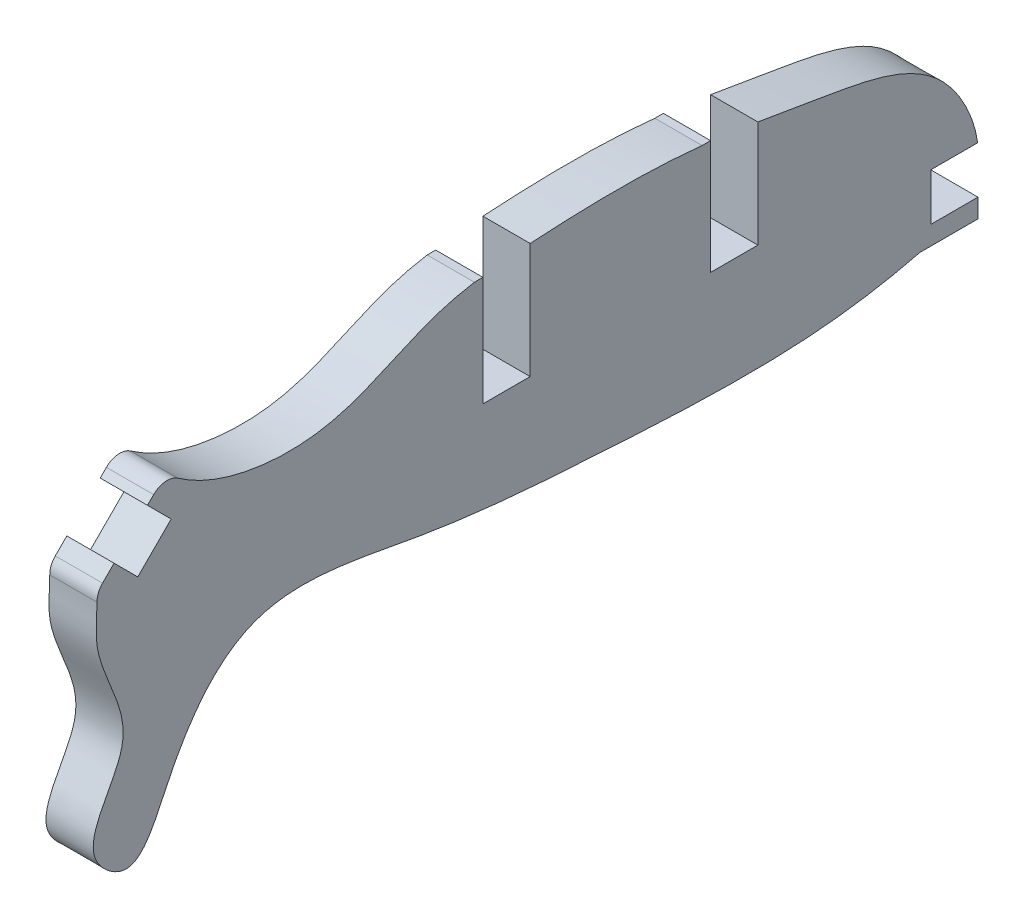
ISO-10303-21;
HEADER;
FILE_DESCRIPTION(('STEP AP214'),'2;1');
FILE_NAME('part.step','',(''),(''),'','','');
FILE_SCHEMA(('AUTOMOTIVE_DESIGN { 1 0 10303 214 1 1 1 1 }'));
ENDSEC;
DATA;
#1=APPLICATION_CONTEXT('core data for automotive mechanical design processes');
#2=APPLICATION_PROTOCOL_DEFINITION('international standard','automotive_design',2000,#1);
#3=PRODUCT_CONTEXT('',#1,'mechanical');
#4=PRODUCT('Part','Part','',(#3));
#5=PRODUCT_RELATED_PRODUCT_CATEGORY('part','',(#4));
#6=PRODUCT_DEFINITION_FORMATION('','',#4);
#7=PRODUCT_DEFINITION_CONTEXT('part definition',#1,'design');
#8=PRODUCT_DEFINITION('design','',#6,#7);
#9=PRODUCT_DEFINITION_SHAPE('','',#8);
#10=(LENGTH_UNIT() NAMED_UNIT(*) SI_UNIT(.MILLI.,.METRE.));
#11=(NAMED_UNIT(*) PLANE_ANGLE_UNIT() SI_UNIT($,.RADIAN.));
#12=(NAMED_UNIT(*) SI_UNIT($,.STERADIAN.) SOLID_ANGLE_UNIT());
#13=UNCERTAINTY_MEASURE_WITH_UNIT(LENGTH_MEASURE(1.E-05),#10,'distance_accuracy_value','');
#14=(GEOMETRIC_REPRESENTATION_CONTEXT(3) GLOBAL_UNCERTAINTY_ASSIGNED_CONTEXT((#13)) GLOBAL_UNIT_ASSIGNED_CONTEXT((#10,
#11,#12)) REPRESENTATION_CONTEXT('',''));
#15=CARTESIAN_POINT('',(0.,0.,0.));
#16=DIRECTION('',(0.,0.,1.));
#17=DIRECTION('',(1.,0.,0.));
#18=AXIS2_PLACEMENT_3D('',#15,#16,#17);
#19=CARTESIAN_POINT('',(2.5,0.,0.));
#20=CARTESIAN_POINT('',(2.5,-0.541084528293463,-0.272473622424354));
#21=CARTESIAN_POINT('',(2.5,-2.10406584461799,-2.1778954166779));
#22=CARTESIAN_POINT('',(2.5,3.36117006970857,-4.25993897825765));
#23=CARTESIAN_POINT('',(2.5,8.30902129392191,-8.27303154593728));
#24=CARTESIAN_POINT('',(2.5,5.98429483389327,-17.5880406060923));
#25=CARTESIAN_POINT('',(2.5,5.37939179539656,-26.3059395788136));
#26=CARTESIAN_POINT('',(2.5,4.87928385677255,-35.2834623387502));
#27=CARTESIAN_POINT('',(2.5,5.48110894278195,-41.5391302106125));
#28=CARTESIAN_POINT('',(2.5,7.22840901590548,-47.7254062217009));
#29=CARTESIAN_POINT('',(2.5,14.6410347918461,-45.3927229469363));
#30=CARTESIAN_POINT('',(2.5,15.770669640676,-38.4007919561818));
#31=CARTESIAN_POINT('',(2.5,17.1217746718688,-31.0703671268736));
#32=CARTESIAN_POINT('',(2.5,16.9701055404972,-24.2198236812376));
#33=CARTESIAN_POINT('',(2.5,16.4230201003298,-17.6842465114785));
#34=CARTESIAN_POINT('',(2.5,13.0552754329594,-12.4328992588877));
#35=CARTESIAN_POINT('',(2.5,14.0463219172787,-5.3266395441336));
#36=CARTESIAN_POINT('',(2.5,17.0233611147964,-2.43679313670869));
#37=CARTESIAN_POINT('',(2.5,18.9835071570872,0.735781673182484));
#38=CARTESIAN_POINT('',(2.5,18.3609569736637,1.5863093965143));
#39=CARTESIAN_POINT('',(2.5,15.5581520784163,2.14979371394474));
#40=CARTESIAN_POINT('',(2.5,13.3832377511273,-0.435409892481267));
#41=CARTESIAN_POINT('',(2.5,8.86671384343193,0.440571098837827));
#42=CARTESIAN_POINT('',(2.5,4.95139910077309,-3.07383649344975));
#43=CARTESIAN_POINT('',(2.5,1.42417024966847,0.717168587503393));
#44=CARTESIAN_POINT('',(2.5,0.,0.));
#45=B_SPLINE_CURVE_WITH_KNOTS('',3,(#19,#20,#21,#22,#23,#24,#25,#26,#27,#28,#29,#30,#31,#32,#33,
#34,#35,#36,#37,#38,#39,#40,#41,#42,#43,#44),.UNSPECIFIED.,.T.,.F.,(4,1,1,1,1,1,1,1,1,1,1,1,1,1,
1,1,1,1,1,1,1,1,1,4),(0.,0.0146402414672483,0.0445395881156549,0.100042075294855,
0.16816746605923,0.246997948314105,0.320837358889482,0.378909911688516,0.408310293551712,
0.453091621050885,0.510176836741603,0.569621449295567,0.635352586889172,0.674982328591815,
0.725528496203896,0.782456251225519,0.824214189069101,0.842758224795276,0.845967518506037,
0.856307126176709,0.898464266637791,0.915761934425582,0.961465916589082,1.),.UNSPECIFIED.);
#46=DIRECTION('',(-1.,0.,0.));
#47=VECTOR('',#46,1.);
#48=SURFACE_OF_LINEAR_EXTRUSION('',#45,#47);
#49=CARTESIAN_POINT('',(0.,0.,0.));
#50=CARTESIAN_POINT('',(0.,-0.541084528293463,-0.272473622424354));
#51=CARTESIAN_POINT('',(0.,-2.10406584461799,-2.1778954166779));
#52=CARTESIAN_POINT('',(0.,3.36117006970857,-4.25993897825765));
#53=CARTESIAN_POINT('',(0.,8.30902129392191,-8.27303154593728));
#54=CARTESIAN_POINT('',(0.,5.98429483389327,-17.5880406060923));
#55=CARTESIAN_POINT('',(0.,5.37939179539656,-26.3059395788136));
#56=CARTESIAN_POINT('',(0.,4.87928385677255,-35.2834623387502));
#57=CARTESIAN_POINT('',(0.,5.48110894278195,-41.5391302106125));
#58=CARTESIAN_POINT('',(0.,7.22840901590548,-47.7254062217009));
#59=CARTESIAN_POINT('',(0.,14.6410347918461,-45.3927229469363));
#60=CARTESIAN_POINT('',(0.,15.770669640676,-38.4007919561818));
#61=CARTESIAN_POINT('',(0.,17.1217746718688,-31.0703671268736));
#62=CARTESIAN_POINT('',(0.,16.9701055404972,-24.2198236812376));
#63=CARTESIAN_POINT('',(0.,16.4230201003298,-17.6842465114785));
#64=CARTESIAN_POINT('',(0.,13.0552754329594,-12.4328992588877));
#65=CARTESIAN_POINT('',(0.,14.0463219172787,-5.3266395441336));
#66=CARTESIAN_POINT('',(0.,17.0233611147964,-2.43679313670869));
#67=CARTESIAN_POINT('',(0.,18.9835071570872,0.735781673182484));
#68=CARTESIAN_POINT('',(0.,18.3609569736637,1.5863093965143));
#69=CARTESIAN_POINT('',(0.,15.5581520784163,2.14979371394474));
#70=CARTESIAN_POINT('',(0.,13.3832377511273,-0.435409892481267));
#71=CARTESIAN_POINT('',(0.,8.86671384343193,0.440571098837827));
#72=CARTESIAN_POINT('',(0.,4.95139910077309,-3.07383649344975));
#73=CARTESIAN_POINT('',(0.,1.42417024966847,0.717168587503393));
#74=CARTESIAN_POINT('',(0.,0.,0.));
#75=B_SPLINE_CURVE_WITH_KNOTS('',3,(#49,#50,#51,#52,#53,#54,#55,#56,#57,#58,#59,#60,#61,#62,#63,
#64,#65,#66,#67,#68,#69,#70,#71,#72,#73,#74),.UNSPECIFIED.,.T.,.F.,(4,1,1,1,1,1,1,1,1,1,1,1,1,1,
1,1,1,1,1,1,1,1,1,4),(0.,0.0146402414672483,0.0445395881156549,0.100042075294855,
0.16816746605923,0.246997948314105,0.320837358889482,0.378909911688516,0.408310293551712,
0.453091621050885,0.510176836741603,0.569621449295567,0.635352586889172,0.674982328591815,
0.725528496203896,0.782456251225519,0.824214189069101,0.842758224795276,0.845967518506037,
0.856307126176709,0.898464266637791,0.915761934425582,0.961465916589082,1.),.UNSPECIFIED.);
#76=CARTESIAN_POINT('',(0.,11.8514874548388,-0.0264150590870313));
#77=VERTEX_POINT('',#76);
#78=CARTESIAN_POINT('',(0.,6.10502250331146,-43.5882828738837));
#79=VERTEX_POINT('',#78);
#80=EDGE_CURVE('E276',#77,#79,#75,.T.);
#81=ORIENTED_EDGE('',*,*,#80,.T.);
#82=DIRECTION('',(-1.,0.,0.));
#83=VECTOR('',#82,1.);
#84=CARTESIAN_POINT('',(2.5,6.10502250331141,-43.5882825718638));
#85=LINE('',#84,#83);
#86=CARTESIAN_POINT('',(2.5,6.10502250331146,-43.5882825249099));
#87=VERTEX_POINT('',#86);
#88=EDGE_CURVE('E233',#87,#79,#85,.T.);
#89=ORIENTED_EDGE('',*,*,#88,.F.);
#90=CARTESIAN_POINT('',(2.5,11.8514874548388,-0.0264150590870313));
#91=VERTEX_POINT('',#90);
#92=EDGE_CURVE('E291',#91,#87,#45,.T.);
#93=ORIENTED_EDGE('',*,*,#92,.F.);
#94=DIRECTION('',(-1.,0.,0.));
#95=VECTOR('',#94,1.);
#96=CARTESIAN_POINT('',(2.5,11.8514874548388,-0.0264150590870314));
#97=LINE('',#96,#95);
#98=EDGE_CURVE('E281',#91,#77,#97,.T.);
#99=ORIENTED_EDGE('',*,*,#98,.T.);
#100=EDGE_LOOP('',(#81,#89,#93,#99));
#101=FACE_BOUND('',#100,.T.);
#102=ADVANCED_FACE('F37',(#101),#48,.F.);
#103=CARTESIAN_POINT('',(2.5,15.5377458684864,-39.8702375089103));
#104=DIRECTION('',(1.,0.,0.));
#105=DIRECTION('',(0.,0.,-1.));
#106=AXIS2_PLACEMENT_3D('',#103,#104,#105);
#107=PLANE('',#106);
#108=DIRECTION('',(0.,0.,1.));
#109=VECTOR('',#108,1.);
#110=CARTESIAN_POINT('',(2.5,7.10268511937784,-39.8702375089103));
#111=LINE('',#110,#109);
#112=CARTESIAN_POINT('',(2.5,7.10268511937784,-46.65));
#113=VERTEX_POINT('',#112);
#114=CARTESIAN_POINT('',(2.5,7.10268511937784,-44.15));
#115=VERTEX_POINT('',#114);
#116=EDGE_CURVE('E227',#113,#115,#111,.T.);
#117=ORIENTED_EDGE('',*,*,#116,.T.);
#118=DIRECTION('',(0.,-1.,0.));
#119=VECTOR('',#118,1.);
#120=CARTESIAN_POINT('',(2.5,15.5377458684864,-44.15));
#121=LINE('',#120,#119);
#122=CARTESIAN_POINT('',(2.5,9.60268511937784,-44.15));
#123=VERTEX_POINT('',#122);
#124=EDGE_CURVE('E363',#123,#115,#121,.T.);
#125=ORIENTED_EDGE('',*,*,#124,.F.);
#126=DIRECTION('',(0.,0.,-1.));
#127=VECTOR('',#126,1.);
#128=CARTESIAN_POINT('',(2.5,9.60268511937784,-39.8702375089103));
#129=LINE('',#128,#127);
#130=CARTESIAN_POINT('',(2.5,9.60268511937785,-46.6323468524195));
#131=VERTEX_POINT('',#130);
#132=EDGE_CURVE('E64',#123,#131,#129,.T.);
#133=ORIENTED_EDGE('',*,*,#132,.T.);
#134=CARTESIAN_POINT('',(2.5,16.373242104138,-35.));
#135=VERTEX_POINT('',#134);
#136=EDGE_CURVE('E372',#131,#135,#45,.T.);
#137=ORIENTED_EDGE('',*,*,#136,.T.);
#138=DIRECTION('',(0.,1.,0.));
#139=VECTOR('',#138,1.);
#140=CARTESIAN_POINT('',(2.5,10.7286242334819,-35.));
#141=LINE('',#140,#139);
#142=CARTESIAN_POINT('',(2.5,10.7286242334819,-35.));
#143=VERTEX_POINT('',#142);
#144=EDGE_CURVE('E335',#143,#135,#141,.T.);
#145=ORIENTED_EDGE('',*,*,#144,.F.);
#146=DIRECTION('',(0.,0.,-1.));
#147=VECTOR('',#146,1.);
#148=CARTESIAN_POINT('',(2.5,10.7286242334819,-32.05));
#149=LINE('',#148,#147);
#150=CARTESIAN_POINT('',(2.5,10.7286242334819,-32.5));
#151=VERTEX_POINT('',#150);
#152=EDGE_CURVE('E280',#151,#143,#149,.T.);
#153=ORIENTED_EDGE('',*,*,#152,.F.);
#154=DIRECTION('',(0.,1.,0.));
#155=VECTOR('',#154,1.);
#156=CARTESIAN_POINT('',(2.5,16.7676365159543,-32.5));
#157=LINE('',#156,#155);
#158=CARTESIAN_POINT('',(2.5,16.7676365159543,-32.5));
#159=VERTEX_POINT('',#158);
#160=EDGE_CURVE('E238',#151,#159,#157,.T.);
#161=ORIENTED_EDGE('',*,*,#160,.T.);
#162=DIRECTION('',(0.,0.,1.));
#163=VECTOR('',#162,1.);
#164=CARTESIAN_POINT('',(2.5,16.7676365159543,-32.05));
#165=LINE('',#164,#163);
#166=CARTESIAN_POINT('',(2.5,16.7676365159543,-32.05));
#167=VERTEX_POINT('',#166);
#168=EDGE_CURVE('E244',#159,#167,#165,.T.);
#169=ORIENTED_EDGE('',*,*,#168,.T.);
#170=CARTESIAN_POINT('',(2.5,16.8294396817294,-22.95));
#171=VERTEX_POINT('',#170);
#172=EDGE_CURVE('E324',#167,#171,#45,.T.);
#173=ORIENTED_EDGE('',*,*,#172,.T.);
#174=DIRECTION('',(0.,1.,0.));
#175=VECTOR('',#174,1.);
#176=CARTESIAN_POINT('',(2.5,10.7286242334819,-22.95));
#177=LINE('',#176,#175);
#178=CARTESIAN_POINT('',(2.5,10.7286242334819,-22.95));
#179=VERTEX_POINT('',#178);
#180=EDGE_CURVE('E320',#179,#171,#177,.T.);
#181=ORIENTED_EDGE('',*,*,#180,.F.);
#182=DIRECTION('',(0.,0.,1.));
#183=VECTOR('',#182,1.);
#184=CARTESIAN_POINT('',(2.5,10.7286242334819,-22.95));
#185=LINE('',#184,#183);
#186=CARTESIAN_POINT('',(2.5,10.7286242334819,-20.45));
#187=VERTEX_POINT('',#186);
#188=EDGE_CURVE('E321',#179,#187,#185,.T.);
#189=ORIENTED_EDGE('',*,*,#188,.T.);
#190=DIRECTION('',(0.,1.,0.));
#191=VECTOR('',#190,1.);
#192=CARTESIAN_POINT('',(2.5,10.7286242334819,-20.45));
#193=LINE('',#192,#191);
#194=CARTESIAN_POINT('',(2.5,16.5272078463722,-20.45));
#195=VERTEX_POINT('',#194);
#196=EDGE_CURVE('E254',#187,#195,#193,.T.);
#197=ORIENTED_EDGE('',*,*,#196,.T.);
#198=DIRECTION('',(0.,0.,1.));
#199=VECTOR('',#198,1.);
#200=CARTESIAN_POINT('',(2.5,16.5272078463722,-20.45));
#201=LINE('',#200,#199);
#202=CARTESIAN_POINT('',(2.5,16.5272078463722,-20.));
#203=VERTEX_POINT('',#202);
#204=EDGE_CURVE('E260',#195,#203,#201,.T.);
#205=ORIENTED_EDGE('',*,*,#204,.T.);
#206=CARTESIAN_POINT('',(2.5,15.3990003489705,-4.29662501733366));
#207=VERTEX_POINT('',#206);
#208=EDGE_CURVE('E288',#203,#207,#45,.T.);
#209=ORIENTED_EDGE('',*,*,#208,.T.);
#210=CARTESIAN_POINT('',(2.5,14.5737930702256,-3.73179500121685));
#211=DIRECTION('',(1.,0.,0.));
#212=DIRECTION('',(0.,0.,-1.));
#213=AXIS2_PLACEMENT_3D('',#210,#211,#212);
#214=CIRCLE('',#213,1.);
#215=CARTESIAN_POINT('',(2.5,15.280899853524,-3.02468822214213));
#216=VERTEX_POINT('',#215);
#217=EDGE_CURVE('E285',#207,#216,#214,.T.);
#218=ORIENTED_EDGE('',*,*,#217,.T.);
#219=DIRECTION('',(0.,0.707106779074716,-0.707106783298379));
#220=VECTOR('',#219,1.);
#221=CARTESIAN_POINT('',(2.5,12.2562116247336,2.4715227884024E-08));
#222=LINE('',#221,#220);
#223=CARTESIAN_POINT('',(2.5,14.9540070717488,-2.69779543841433));
#224=VERTEX_POINT('',#223);
#225=EDGE_CURVE('E303',#224,#216,#222,.T.);
#226=ORIENTED_EDGE('',*,*,#225,.F.);
#227=DIRECTION('',(0.,0.707106783298379,0.707106779074716));
#228=VECTOR('',#227,1.);
#229=CARTESIAN_POINT('',(2.5,13.6988925313942,-3.95290997127195));
#230=LINE('',#229,#228);
#231=CARTESIAN_POINT('',(2.5,13.6988925313942,-3.95290997127195));
#232=VERTEX_POINT('',#231);
#233=EDGE_CURVE('E353',#232,#224,#230,.T.);
#234=ORIENTED_EDGE('',*,*,#233,.F.);
#235=DIRECTION('',(0.,0.707106779074717,-0.707106783298378));
#236=VECTOR('',#235,1.);
#237=CARTESIAN_POINT('',(2.5,11.9311255837074,-2.185143013026));
#238=LINE('',#237,#236);
#239=CARTESIAN_POINT('',(2.5,11.9311255837074,-2.185143013026));
#240=VERTEX_POINT('',#239);
#241=EDGE_CURVE('E364',#240,#232,#238,.T.);
#242=ORIENTED_EDGE('',*,*,#241,.F.);
#243=DIRECTION('',(0.,0.707106783298379,0.707106779074716));
#244=VECTOR('',#243,1.);
#245=CARTESIAN_POINT('',(2.5,11.9311255837074,-2.185143013026));
#246=LINE('',#245,#244);
#247=CARTESIAN_POINT('',(2.5,13.186240124062,-0.93002848016838));
#248=VERTEX_POINT('',#247);
#249=EDGE_CURVE('E287',#240,#248,#246,.T.);
#250=ORIENTED_EDGE('',*,*,#249,.T.);
#251=CARTESIAN_POINT('',(2.5,12.5753790526333,-0.319167405090885));
#252=VERTEX_POINT('',#251);
#253=EDGE_CURVE('E279',#252,#248,#222,.T.);
#254=ORIENTED_EDGE('',*,*,#253,.F.);
#255=CARTESIAN_POINT('',(2.5,11.8682722693352,-1.02627418416532));
#256=DIRECTION('',(1.,0.,0.));
#257=DIRECTION('',(0.,0.,-1.));
#258=AXIS2_PLACEMENT_3D('',#255,#256,#257);
#259=CIRCLE('',#258,1.);
#260=EDGE_CURVE('E289',#252,#91,#259,.T.);
#261=ORIENTED_EDGE('',*,*,#260,.T.);
#262=ORIENTED_EDGE('',*,*,#92,.T.);
#263=DIRECTION('',(0.,0.,-1.));
#264=VECTOR('',#263,1.);
#265=CARTESIAN_POINT('',(2.5,6.10502250331146,0.174173426554514));
#266=LINE('',#265,#264);
#267=CARTESIAN_POINT('',(2.5,6.10502250331146,-46.65));
#268=VERTEX_POINT('',#267);
#269=EDGE_CURVE('E235',#87,#268,#266,.T.);
#270=ORIENTED_EDGE('',*,*,#269,.T.);
#271=DIRECTION('',(0.,1.,0.));
#272=VECTOR('',#271,1.);
#273=CARTESIAN_POINT('',(2.5,7.10268511937784,-46.65));
#274=LINE('',#273,#272);
#275=EDGE_CURVE('E231',#268,#113,#274,.T.);
#276=ORIENTED_EDGE('',*,*,#275,.T.);
#277=EDGE_LOOP('',(#117,#125,#133,#137,#145,#153,#161,#169,#173,#181,#189,#197,#205,#209,#218,
#226,#234,#242,#250,#254,#261,#262,#270,#276));
#278=FACE_BOUND('',#277,.T.);
#279=ADVANCED_FACE('F39',(#278),#107,.T.);
#280=DIRECTION('',(-1.,0.,0.));
#281=VECTOR('',#280,1.);
#282=CARTESIAN_POINT('',(2.5,9.60268511937785,-46.6323468524195));
#283=LINE('',#282,#281);
#284=CARTESIAN_POINT('',(0.,9.60268511937784,-46.6323468498637));
#285=VERTEX_POINT('',#284);
#286=EDGE_CURVE('E213',#285,#131,#283,.F.);
#287=ORIENTED_EDGE('',*,*,#286,.F.);
#288=CARTESIAN_POINT('',(0.,16.373242104138,-35.));
#289=VERTEX_POINT('',#288);
#290=EDGE_CURVE('E334',#285,#289,#75,.T.);
#291=ORIENTED_EDGE('',*,*,#290,.T.);
#292=DIRECTION('',(-1.,0.,0.));
#293=VECTOR('',#292,1.);
#294=CARTESIAN_POINT('',(2.5,16.3732421067557,-35.));
#295=LINE('',#294,#293);
#296=EDGE_CURVE('E284',#289,#135,#295,.F.);
#297=ORIENTED_EDGE('',*,*,#296,.T.);
#298=ORIENTED_EDGE('',*,*,#136,.F.);
#299=EDGE_LOOP('',(#287,#291,#297,#298));
#300=FACE_BOUND('',#299,.T.);
#301=ADVANCED_FACE('F389',(#300),#48,.F.);
#302=CARTESIAN_POINT('',(0.,15.5377458684864,-39.8702375089103));
#303=DIRECTION('',(1.,0.,0.));
#304=DIRECTION('',(0.,0.,-1.));
#305=AXIS2_PLACEMENT_3D('',#302,#303,#304);
#306=PLANE('',#305);
#307=DIRECTION('',(0.,0.,1.));
#308=VECTOR('',#307,1.);
#309=CARTESIAN_POINT('',(0.,7.10268511937784,-39.8702375089103));
#310=LINE('',#309,#308);
#311=CARTESIAN_POINT('',(0.,7.10268511937784,-46.65));
#312=VERTEX_POINT('',#311);
#313=CARTESIAN_POINT('',(0.,7.10268511937784,-44.15));
#314=VERTEX_POINT('',#313);
#315=EDGE_CURVE('E48',#312,#314,#310,.T.);
#316=ORIENTED_EDGE('',*,*,#315,.F.);
#317=DIRECTION('',(0.,-1.,0.));
#318=VECTOR('',#317,1.);
#319=CARTESIAN_POINT('',(0.,7.10268511937784,-46.65));
#320=LINE('',#319,#318);
#321=CARTESIAN_POINT('',(0.,6.10502250331146,-46.65));
#322=VERTEX_POINT('',#321);
#323=EDGE_CURVE('E208',#312,#322,#320,.T.);
#324=ORIENTED_EDGE('',*,*,#323,.T.);
#325=DIRECTION('',(0.,0.,-1.));
#326=VECTOR('',#325,1.);
#327=CARTESIAN_POINT('',(0.,6.10502250331146,0.174173426554514));
#328=LINE('',#327,#326);
#329=EDGE_CURVE('E236',#79,#322,#328,.T.);
#330=ORIENTED_EDGE('',*,*,#329,.F.);
#331=ORIENTED_EDGE('',*,*,#80,.F.);
#332=CARTESIAN_POINT('',(0.,11.8682722693352,-1.02627418416532));
#333=DIRECTION('',(1.,0.,0.));
#334=DIRECTION('',(0.,0.,-1.));
#335=AXIS2_PLACEMENT_3D('',#332,#333,#334);
#336=CIRCLE('',#335,1.);
#337=CARTESIAN_POINT('',(0.,12.5753790526333,-0.319167405090885));
#338=VERTEX_POINT('',#337);
#339=EDGE_CURVE('E275',#77,#338,#336,.F.);
#340=ORIENTED_EDGE('',*,*,#339,.T.);
#341=DIRECTION('',(0.,0.707106779074716,-0.707106783298379));
#342=VECTOR('',#341,1.);
#343=CARTESIAN_POINT('',(0.,12.2562116247336,2.4715227884024E-08));
#344=LINE('',#343,#342);
#345=CARTESIAN_POINT('',(0.,13.186240124062,-0.930028480168383));
#346=VERTEX_POINT('',#345);
#347=EDGE_CURVE('E299',#338,#346,#344,.T.);
#348=ORIENTED_EDGE('',*,*,#347,.T.);
#349=DIRECTION('',(0.,0.707106783298379,0.707106779074716));
#350=VECTOR('',#349,1.);
#351=CARTESIAN_POINT('',(0.,11.9311255837074,-2.185143013026));
#352=LINE('',#351,#350);
#353=CARTESIAN_POINT('',(0.,11.9311255837074,-2.185143013026));
#354=VERTEX_POINT('',#353);
#355=EDGE_CURVE('E346',#354,#346,#352,.T.);
#356=ORIENTED_EDGE('',*,*,#355,.F.);
#357=DIRECTION('',(0.,-0.707106779074717,0.707106783298378));
#358=VECTOR('',#357,1.);
#359=CARTESIAN_POINT('',(0.,11.9311255837074,-2.185143013026));
#360=LINE('',#359,#358);
#361=CARTESIAN_POINT('',(0.,13.6988925313942,-3.95290997127195));
#362=VERTEX_POINT('',#361);
#363=EDGE_CURVE('E349',#362,#354,#360,.T.);
#364=ORIENTED_EDGE('',*,*,#363,.F.);
#365=DIRECTION('',(0.,0.707106783298379,0.707106779074716));
#366=VECTOR('',#365,1.);
#367=CARTESIAN_POINT('',(0.,13.6988925313942,-3.95290997127195));
#368=LINE('',#367,#366);
#369=CARTESIAN_POINT('',(0.,14.9540070717488,-2.69779543841433));
#370=VERTEX_POINT('',#369);
#371=EDGE_CURVE('E345',#362,#370,#368,.T.);
#372=ORIENTED_EDGE('',*,*,#371,.T.);
#373=CARTESIAN_POINT('',(0.,15.280899853524,-3.02468822214213));
#374=VERTEX_POINT('',#373);
#375=EDGE_CURVE('E297',#370,#374,#344,.T.);
#376=ORIENTED_EDGE('',*,*,#375,.T.);
#377=CARTESIAN_POINT('',(0.,14.5737930702256,-3.73179500121685));
#378=DIRECTION('',(1.,0.,0.));
#379=DIRECTION('',(0.,0.,-1.));
#380=AXIS2_PLACEMENT_3D('',#377,#378,#379);
#381=CIRCLE('',#380,1.);
#382=CARTESIAN_POINT('',(0.,15.3990003489705,-4.29662501733366));
#383=VERTEX_POINT('',#382);
#384=EDGE_CURVE('E295',#374,#383,#381,.F.);
#385=ORIENTED_EDGE('',*,*,#384,.T.);
#386=CARTESIAN_POINT('',(0.,16.5272078463722,-20.));
#387=VERTEX_POINT('',#386);
#388=EDGE_CURVE('E41',#387,#383,#75,.T.);
#389=ORIENTED_EDGE('',*,*,#388,.F.);
#390=DIRECTION('',(0.,0.,1.));
#391=VECTOR('',#390,1.);
#392=CARTESIAN_POINT('',(0.,16.5272078463722,-20.45));
#393=LINE('',#392,#391);
#394=CARTESIAN_POINT('',(0.,16.5272078463722,-20.45));
#395=VERTEX_POINT('',#394);
#396=EDGE_CURVE('E259',#395,#387,#393,.T.);
#397=ORIENTED_EDGE('',*,*,#396,.F.);
#398=DIRECTION('',(0.,1.,0.));
#399=VECTOR('',#398,1.);
#400=CARTESIAN_POINT('',(0.,10.7286242334819,-20.45));
#401=LINE('',#400,#399);
#402=CARTESIAN_POINT('',(0.,10.7286242334819,-20.45));
#403=VERTEX_POINT('',#402);
#404=EDGE_CURVE('E256',#403,#395,#401,.T.);
#405=ORIENTED_EDGE('',*,*,#404,.F.);
#406=DIRECTION('',(0.,0.,1.));
#407=VECTOR('',#406,1.);
#408=CARTESIAN_POINT('',(0.,10.7286242334819,-22.95));
#409=LINE('',#408,#407);
#410=CARTESIAN_POINT('',(0.,10.7286242334819,-22.95));
#411=VERTEX_POINT('',#410);
#412=EDGE_CURVE('E316',#411,#403,#409,.T.);
#413=ORIENTED_EDGE('',*,*,#412,.F.);
#414=DIRECTION('',(0.,-1.,0.));
#415=VECTOR('',#414,1.);
#416=CARTESIAN_POINT('',(0.,15.5377458684864,-22.95));
#417=LINE('',#416,#415);
#418=CARTESIAN_POINT('',(0.,16.8294396817294,-22.95));
#419=VERTEX_POINT('',#418);
#420=EDGE_CURVE('E307',#419,#411,#417,.T.);
#421=ORIENTED_EDGE('',*,*,#420,.F.);
#422=CARTESIAN_POINT('',(0.,16.7676365159543,-32.05));
#423=VERTEX_POINT('',#422);
#424=EDGE_CURVE('E313',#423,#419,#75,.T.);
#425=ORIENTED_EDGE('',*,*,#424,.F.);
#426=DIRECTION('',(0.,0.,1.));
#427=VECTOR('',#426,1.);
#428=CARTESIAN_POINT('',(0.,16.7676365159543,-32.05));
#429=LINE('',#428,#427);
#430=CARTESIAN_POINT('',(0.,16.7676365159543,-32.5));
#431=VERTEX_POINT('',#430);
#432=EDGE_CURVE('E243',#431,#423,#429,.T.);
#433=ORIENTED_EDGE('',*,*,#432,.F.);
#434=DIRECTION('',(0.,1.,0.));
#435=VECTOR('',#434,1.);
#436=CARTESIAN_POINT('',(0.,16.7676365159543,-32.5));
#437=LINE('',#436,#435);
#438=CARTESIAN_POINT('',(0.,10.7286242334819,-32.5));
#439=VERTEX_POINT('',#438);
#440=EDGE_CURVE('E240',#439,#431,#437,.T.);
#441=ORIENTED_EDGE('',*,*,#440,.F.);
#442=DIRECTION('',(0.,0.,-1.));
#443=VECTOR('',#442,1.);
#444=CARTESIAN_POINT('',(0.,10.7286242334819,-32.05));
#445=LINE('',#444,#443);
#446=CARTESIAN_POINT('',(0.,10.7286242334819,-35.));
#447=VERTEX_POINT('',#446);
#448=EDGE_CURVE('E56',#439,#447,#445,.T.);
#449=ORIENTED_EDGE('',*,*,#448,.T.);
#450=DIRECTION('',(0.,1.,0.));
#451=VECTOR('',#450,1.);
#452=CARTESIAN_POINT('',(0.,15.5377458684864,-35.));
#453=LINE('',#452,#451);
#454=EDGE_CURVE('E304',#447,#289,#453,.T.);
#455=ORIENTED_EDGE('',*,*,#454,.T.);
#456=ORIENTED_EDGE('',*,*,#290,.F.);
#457=DIRECTION('',(0.,0.,-1.));
#458=VECTOR('',#457,1.);
#459=CARTESIAN_POINT('',(0.,9.60268511937784,-39.8702375089103));
#460=LINE('',#459,#458);
#461=CARTESIAN_POINT('',(0.,9.60268511937784,-44.15));
#462=VERTEX_POINT('',#461);
#463=EDGE_CURVE('E271',#462,#285,#460,.T.);
#464=ORIENTED_EDGE('',*,*,#463,.F.);
#465=DIRECTION('',(0.,-1.,0.));
#466=VECTOR('',#465,1.);
#467=CARTESIAN_POINT('',(0.,15.5377458684864,-44.15));
#468=LINE('',#467,#466);
#469=EDGE_CURVE('E210',#462,#314,#468,.T.);
#470=ORIENTED_EDGE('',*,*,#469,.T.);
#471=EDGE_LOOP('',(#316,#324,#330,#331,#340,#348,#356,#364,#372,#376,#385,#389,#397,#405,#413,
#421,#425,#433,#441,#449,#455,#456,#464,#470));
#472=FACE_BOUND('',#471,.T.);
#473=ADVANCED_FACE('F206',(#472),#306,.F.);
#474=CARTESIAN_POINT('',(71.2924520643256,12.2562116247336,2.4715227884024E-08));
#475=DIRECTION('',(0.,0.707106783298379,0.707106779074716));
#476=DIRECTION('',(0.,-0.707106779074716,0.707106783298379));
#477=AXIS2_PLACEMENT_3D('',#474,#475,#476);
#478=PLANE('',#477);
#479=ORIENTED_EDGE('',*,*,#225,.T.);
#480=DIRECTION('',(1.,0.,0.));
#481=VECTOR('',#480,1.);
#482=CARTESIAN_POINT('',(0.,15.280899853524,-3.02468822214213));
#483=LINE('',#482,#481);
#484=EDGE_CURVE('E300',#216,#374,#483,.F.);
#485=ORIENTED_EDGE('',*,*,#484,.T.);
#486=ORIENTED_EDGE('',*,*,#375,.F.);
#487=DIRECTION('',(-1.,0.,0.));
#488=VECTOR('',#487,1.);
#489=CARTESIAN_POINT('',(2.5,14.9540070717488,-2.69779543841433));
#490=LINE('',#489,#488);
#491=EDGE_CURVE('E343',#224,#370,#490,.T.);
#492=ORIENTED_EDGE('',*,*,#491,.F.);
#493=EDGE_LOOP('',(#479,#485,#486,#492));
#494=FACE_BOUND('',#493,.T.);
#495=ADVANCED_FACE('F387',(#494),#478,.T.);
#496=ORIENTED_EDGE('',*,*,#388,.T.);
#497=DIRECTION('',(-1.,0.,0.));
#498=VECTOR('',#497,1.);
#499=CARTESIAN_POINT('',(0.,15.3990003489705,-4.29662501733366));
#500=LINE('',#499,#498);
#501=EDGE_CURVE('E292',#383,#207,#500,.F.);
#502=ORIENTED_EDGE('',*,*,#501,.T.);
#503=ORIENTED_EDGE('',*,*,#208,.F.);
#504=DIRECTION('',(-1.,0.,0.));
#505=VECTOR('',#504,1.);
#506=CARTESIAN_POINT('',(2.5,16.5272078450596,-20.));
#507=LINE('',#506,#505);
#508=EDGE_CURVE('E294',#203,#387,#507,.T.);
#509=ORIENTED_EDGE('',*,*,#508,.T.);
#510=EDGE_LOOP('',(#496,#502,#503,#509));
#511=FACE_BOUND('',#510,.T.);
#512=ADVANCED_FACE('F383',(#511),#48,.F.);
#513=DIRECTION('',(-1.,0.,0.));
#514=VECTOR('',#513,1.);
#515=CARTESIAN_POINT('',(2.5,16.7676365179862,-32.05));
#516=LINE('',#515,#514);
#517=EDGE_CURVE('E319',#423,#167,#516,.F.);
#518=ORIENTED_EDGE('',*,*,#517,.F.);
#519=ORIENTED_EDGE('',*,*,#424,.T.);
#520=DIRECTION('',(-1.,0.,0.));
#521=VECTOR('',#520,1.);
#522=CARTESIAN_POINT('',(2.5,16.8294396817296,-22.95));
#523=LINE('',#522,#521);
#524=EDGE_CURVE('E310',#171,#419,#523,.T.);
#525=ORIENTED_EDGE('',*,*,#524,.F.);
#526=ORIENTED_EDGE('',*,*,#172,.F.);
#527=EDGE_LOOP('',(#518,#519,#525,#526));
#528=FACE_BOUND('',#527,.T.);
#529=ADVANCED_FACE('F386',(#528),#48,.F.);
#530=CARTESIAN_POINT('',(0.,0.,-22.95));
#531=DIRECTION('',(0.,0.,1.));
#532=DIRECTION('',(1.,0.,0.));
#533=AXIS2_PLACEMENT_3D('',#530,#531,#532);
#534=PLANE('',#533);
#535=ORIENTED_EDGE('',*,*,#524,.T.);
#536=ORIENTED_EDGE('',*,*,#420,.T.);
#537=DIRECTION('',(1.,0.,0.));
#538=VECTOR('',#537,1.);
#539=CARTESIAN_POINT('',(0.,10.7286242334819,-22.95));
#540=LINE('',#539,#538);
#541=EDGE_CURVE('E309',#411,#179,#540,.T.);
#542=ORIENTED_EDGE('',*,*,#541,.T.);
#543=ORIENTED_EDGE('',*,*,#180,.T.);
#544=EDGE_LOOP('',(#535,#536,#542,#543));
#545=FACE_BOUND('',#544,.T.);
#546=ADVANCED_FACE('F428',(#545),#534,.T.);
#547=CARTESIAN_POINT('',(0.,10.7286242334819,-22.95));
#548=DIRECTION('',(0.,-1.,0.));
#549=DIRECTION('',(0.,0.,-1.));
#550=AXIS2_PLACEMENT_3D('',#547,#548,#549);
#551=PLANE('',#550);
#552=ORIENTED_EDGE('',*,*,#412,.T.);
#553=DIRECTION('',(1.,0.,0.));
#554=VECTOR('',#553,1.);
#555=CARTESIAN_POINT('',(0.,10.7286242334819,-20.45));
#556=LINE('',#555,#554);
#557=EDGE_CURVE('E262',#403,#187,#556,.T.);
#558=ORIENTED_EDGE('',*,*,#557,.T.);
#559=ORIENTED_EDGE('',*,*,#188,.F.);
#560=ORIENTED_EDGE('',*,*,#541,.F.);
#561=EDGE_LOOP('',(#552,#558,#559,#560));
#562=FACE_BOUND('',#561,.T.);
#563=ADVANCED_FACE('F426',(#562),#551,.F.);
#564=CARTESIAN_POINT('',(0.,0.,-35.));
#565=DIRECTION('',(0.,0.,-1.));
#566=DIRECTION('',(1.,0.,0.));
#567=AXIS2_PLACEMENT_3D('',#564,#565,#566);
#568=PLANE('',#567);
#569=ORIENTED_EDGE('',*,*,#454,.F.);
#570=DIRECTION('',(1.,0.,0.));
#571=VECTOR('',#570,1.);
#572=CARTESIAN_POINT('',(0.,10.7286242334819,-35.));
#573=LINE('',#572,#571);
#574=EDGE_CURVE('E331',#447,#143,#573,.T.);
#575=ORIENTED_EDGE('',*,*,#574,.T.);
#576=ORIENTED_EDGE('',*,*,#144,.T.);
#577=ORIENTED_EDGE('',*,*,#296,.F.);
#578=EDGE_LOOP('',(#569,#575,#576,#577));
#579=FACE_BOUND('',#578,.T.);
#580=ADVANCED_FACE('F423',(#579),#568,.F.);
#581=CARTESIAN_POINT('',(0.,10.7286242334819,-32.05));
#582=DIRECTION('',(0.,-1.,0.));
#583=DIRECTION('',(0.,0.,1.));
#584=AXIS2_PLACEMENT_3D('',#581,#582,#583);
#585=PLANE('',#584);
#586=ORIENTED_EDGE('',*,*,#448,.F.);
#587=DIRECTION('',(1.,0.,0.));
#588=VECTOR('',#587,1.);
#589=CARTESIAN_POINT('',(0.,10.7286242334819,-32.5));
#590=LINE('',#589,#588);
#591=EDGE_CURVE('E247',#439,#151,#590,.T.);
#592=ORIENTED_EDGE('',*,*,#591,.T.);
#593=ORIENTED_EDGE('',*,*,#152,.T.);
#594=ORIENTED_EDGE('',*,*,#574,.F.);
#595=EDGE_LOOP('',(#586,#592,#593,#594));
#596=FACE_BOUND('',#595,.T.);
#597=ADVANCED_FACE('F419',(#596),#585,.F.);
#598=ORIENTED_EDGE('',*,*,#347,.F.);
#599=DIRECTION('',(1.,0.,0.));
#600=VECTOR('',#599,1.);
#601=CARTESIAN_POINT('',(2.5,12.5753790526333,-0.319167405090886));
#602=LINE('',#601,#600);
#603=EDGE_CURVE('E277',#338,#252,#602,.T.);
#604=ORIENTED_EDGE('',*,*,#603,.T.);
#605=ORIENTED_EDGE('',*,*,#253,.T.);
#606=DIRECTION('',(1.,0.,0.));
#607=VECTOR('',#606,1.);
#608=CARTESIAN_POINT('',(2.5,13.186240124062,-0.93002848016838));
#609=LINE('',#608,#607);
#610=EDGE_CURVE('E350',#346,#248,#609,.T.);
#611=ORIENTED_EDGE('',*,*,#610,.F.);
#612=EDGE_LOOP('',(#598,#604,#605,#611));
#613=FACE_BOUND('',#612,.T.);
#614=ADVANCED_FACE('F412',(#613),#478,.T.);
#615=CARTESIAN_POINT('',(2.5,13.6988925313942,-3.95290997127195));
#616=DIRECTION('',(0.,0.707106779074716,-0.707106783298379));
#617=DIRECTION('',(0.,0.707106783298379,0.707106779074716));
#618=AXIS2_PLACEMENT_3D('',#615,#616,#617);
#619=PLANE('',#618);
#620=ORIENTED_EDGE('',*,*,#491,.T.);
#621=ORIENTED_EDGE('',*,*,#371,.F.);
#622=DIRECTION('',(-1.,0.,0.));
#623=VECTOR('',#622,1.);
#624=CARTESIAN_POINT('',(2.5,13.6988925313942,-3.95290997127195));
#625=LINE('',#624,#623);
#626=EDGE_CURVE('E360',#232,#362,#625,.T.);
#627=ORIENTED_EDGE('',*,*,#626,.F.);
#628=ORIENTED_EDGE('',*,*,#233,.T.);
#629=EDGE_LOOP('',(#620,#621,#627,#628));
#630=FACE_BOUND('',#629,.T.);
#631=ADVANCED_FACE('F409',(#630),#619,.F.);
#632=CARTESIAN_POINT('',(2.5,11.9311255837074,-2.185143013026));
#633=DIRECTION('',(0.,-0.707106779074716,0.707106783298379));
#634=DIRECTION('',(0.,-0.707106783298379,-0.707106779074716));
#635=AXIS2_PLACEMENT_3D('',#632,#633,#634);
#636=PLANE('',#635);
#637=ORIENTED_EDGE('',*,*,#610,.T.);
#638=ORIENTED_EDGE('',*,*,#249,.F.);
#639=DIRECTION('',(1.,0.,0.));
#640=VECTOR('',#639,1.);
#641=CARTESIAN_POINT('',(2.5,11.9311255837074,-2.185143013026));
#642=LINE('',#641,#640);
#643=EDGE_CURVE('E366',#354,#240,#642,.T.);
#644=ORIENTED_EDGE('',*,*,#643,.F.);
#645=ORIENTED_EDGE('',*,*,#355,.T.);
#646=EDGE_LOOP('',(#637,#638,#644,#645));
#647=FACE_BOUND('',#646,.T.);
#648=ADVANCED_FACE('F407',(#647),#636,.F.);
#649=CARTESIAN_POINT('',(0.,4.87299132097395,4.87299129186681));
#650=DIRECTION('',(0.,0.707106783298378,0.707106779074717));
#651=DIRECTION('',(0.,-0.707106779074717,0.707106783298378));
#652=AXIS2_PLACEMENT_3D('',#649,#650,#651);
#653=PLANE('',#652);
#654=ORIENTED_EDGE('',*,*,#363,.T.);
#655=ORIENTED_EDGE('',*,*,#643,.T.);
#656=ORIENTED_EDGE('',*,*,#241,.T.);
#657=ORIENTED_EDGE('',*,*,#626,.T.);
#658=EDGE_LOOP('',(#654,#655,#656,#657));
#659=FACE_BOUND('',#658,.T.);
#660=ADVANCED_FACE('F403',(#659),#653,.T.);
#661=CARTESIAN_POINT('',(1.25,14.5737930702256,-3.73179500121685));
#662=DIRECTION('',(-1.,0.,0.));
#663=DIRECTION('',(0.,0.,1.));
#664=AXIS2_PLACEMENT_3D('',#661,#662,#663);
#665=CYLINDRICAL_SURFACE('',#664,1.);
#666=ORIENTED_EDGE('',*,*,#217,.F.);
#667=ORIENTED_EDGE('',*,*,#501,.F.);
#668=ORIENTED_EDGE('',*,*,#384,.F.);
#669=ORIENTED_EDGE('',*,*,#484,.F.);
#670=EDGE_LOOP('',(#666,#667,#668,#669));
#671=FACE_BOUND('',#670,.T.);
#672=ADVANCED_FACE('F406',(#671),#665,.T.);
#673=CARTESIAN_POINT('',(1.25,11.8682722693352,-1.02627418416532));
#674=DIRECTION('',(-1.,0.,0.));
#675=DIRECTION('',(0.,0.,1.));
#676=AXIS2_PLACEMENT_3D('',#673,#674,#675);
#677=CYLINDRICAL_SURFACE('',#676,1.);
#678=ORIENTED_EDGE('',*,*,#260,.F.);
#679=ORIENTED_EDGE('',*,*,#603,.F.);
#680=ORIENTED_EDGE('',*,*,#339,.F.);
#681=ORIENTED_EDGE('',*,*,#98,.F.);
#682=EDGE_LOOP('',(#678,#679,#680,#681));
#683=FACE_BOUND('',#682,.T.);
#684=ADVANCED_FACE('F396',(#683),#677,.T.);
#685=CARTESIAN_POINT('',(0.,0.,-44.15));
#686=DIRECTION('',(0.,0.,1.));
#687=DIRECTION('',(1.,0.,0.));
#688=AXIS2_PLACEMENT_3D('',#685,#686,#687);
#689=PLANE('',#688);
#690=ORIENTED_EDGE('',*,*,#124,.T.);
#691=DIRECTION('',(1.,0.,0.));
#692=VECTOR('',#691,1.);
#693=CARTESIAN_POINT('',(2.82272229520153,7.10268511937784,-44.15));
#694=LINE('',#693,#692);
#695=EDGE_CURVE('E11',#314,#115,#694,.T.);
#696=ORIENTED_EDGE('',*,*,#695,.F.);
#697=ORIENTED_EDGE('',*,*,#469,.F.);
#698=DIRECTION('',(-1.,0.,0.));
#699=VECTOR('',#698,1.);
#700=CARTESIAN_POINT('',(2.82272229520153,9.60268511937784,-44.15));
#701=LINE('',#700,#699);
#702=EDGE_CURVE('E272',#123,#462,#701,.T.);
#703=ORIENTED_EDGE('',*,*,#702,.F.);
#704=EDGE_LOOP('',(#690,#696,#697,#703));
#705=FACE_BOUND('',#704,.T.);
#706=ADVANCED_FACE('F392',(#705),#689,.F.);
#707=CARTESIAN_POINT('',(2.82272229520153,9.60268511937784,-44.15));
#708=DIRECTION('',(0.,-1.,0.));
#709=DIRECTION('',(0.,0.,-1.));
#710=AXIS2_PLACEMENT_3D('',#707,#708,#709);
#711=PLANE('',#710);
#712=ORIENTED_EDGE('',*,*,#702,.T.);
#713=ORIENTED_EDGE('',*,*,#463,.T.);
#714=ORIENTED_EDGE('',*,*,#286,.T.);
#715=ORIENTED_EDGE('',*,*,#132,.F.);
#716=EDGE_LOOP('',(#712,#713,#714,#715));
#717=FACE_BOUND('',#716,.T.);
#718=ADVANCED_FACE('F395',(#717),#711,.T.);
#719=CARTESIAN_POINT('',(2.82272229520153,7.10268511937784,-44.15));
#720=DIRECTION('',(0.,1.,0.));
#721=DIRECTION('',(0.,0.,1.));
#722=AXIS2_PLACEMENT_3D('',#719,#720,#721);
#723=PLANE('',#722);
#724=ORIENTED_EDGE('',*,*,#116,.F.);
#725=DIRECTION('',(-1.,0.,0.));
#726=VECTOR('',#725,1.);
#727=CARTESIAN_POINT('',(2.5,7.10268511937784,-46.65));
#728=LINE('',#727,#726);
#729=EDGE_CURVE('E220',#113,#312,#728,.T.);
#730=ORIENTED_EDGE('',*,*,#729,.T.);
#731=ORIENTED_EDGE('',*,*,#315,.T.);
#732=ORIENTED_EDGE('',*,*,#695,.T.);
#733=EDGE_LOOP('',(#724,#730,#731,#732));
#734=FACE_BOUND('',#733,.T.);
#735=ADVANCED_FACE('F225',(#734),#723,.T.);
#736=CARTESIAN_POINT('',(0.,16.5272078463722,-20.45));
#737=DIRECTION('',(0.,1.,0.));
#738=DIRECTION('',(0.,0.,1.));
#739=AXIS2_PLACEMENT_3D('',#736,#737,#738);
#740=PLANE('',#739);
#741=ORIENTED_EDGE('',*,*,#204,.F.);
#742=DIRECTION('',(1.,0.,0.));
#743=VECTOR('',#742,1.);
#744=CARTESIAN_POINT('',(0.,16.5272078463722,-20.45));
#745=LINE('',#744,#743);
#746=EDGE_CURVE('E267',#395,#195,#745,.T.);
#747=ORIENTED_EDGE('',*,*,#746,.F.);
#748=ORIENTED_EDGE('',*,*,#396,.T.);
#749=ORIENTED_EDGE('',*,*,#508,.F.);
#750=EDGE_LOOP('',(#741,#747,#748,#749));
#751=FACE_BOUND('',#750,.T.);
#752=ADVANCED_FACE('F400',(#751),#740,.T.);
#753=CARTESIAN_POINT('',(0.,10.7286242334819,-20.45));
#754=DIRECTION('',(0.,0.,-1.));
#755=DIRECTION('',(-1.,0.,0.));
#756=AXIS2_PLACEMENT_3D('',#753,#754,#755);
#757=PLANE('',#756);
#758=ORIENTED_EDGE('',*,*,#196,.F.);
#759=ORIENTED_EDGE('',*,*,#557,.F.);
#760=ORIENTED_EDGE('',*,*,#404,.T.);
#761=ORIENTED_EDGE('',*,*,#746,.T.);
#762=EDGE_LOOP('',(#758,#759,#760,#761));
#763=FACE_BOUND('',#762,.T.);
#764=ADVANCED_FACE('F441',(#763),#757,.T.);
#765=CARTESIAN_POINT('',(0.,16.7676365159543,-32.05));
#766=DIRECTION('',(0.,1.,0.));
#767=DIRECTION('',(0.,0.,1.));
#768=AXIS2_PLACEMENT_3D('',#765,#766,#767);
#769=PLANE('',#768);
#770=ORIENTED_EDGE('',*,*,#168,.F.);
#771=DIRECTION('',(1.,0.,0.));
#772=VECTOR('',#771,1.);
#773=CARTESIAN_POINT('',(0.,16.7676365159543,-32.5));
#774=LINE('',#773,#772);
#775=EDGE_CURVE('E252',#431,#159,#774,.T.);
#776=ORIENTED_EDGE('',*,*,#775,.F.);
#777=ORIENTED_EDGE('',*,*,#432,.T.);
#778=ORIENTED_EDGE('',*,*,#517,.T.);
#779=EDGE_LOOP('',(#770,#776,#777,#778));
#780=FACE_BOUND('',#779,.T.);
#781=ADVANCED_FACE('F444',(#780),#769,.T.);
#782=CARTESIAN_POINT('',(0.,16.7676365159543,-32.5));
#783=DIRECTION('',(0.,0.,-1.));
#784=DIRECTION('',(-1.,0.,0.));
#785=AXIS2_PLACEMENT_3D('',#782,#783,#784);
#786=PLANE('',#785);
#787=ORIENTED_EDGE('',*,*,#160,.F.);
#788=ORIENTED_EDGE('',*,*,#591,.F.);
#789=ORIENTED_EDGE('',*,*,#440,.T.);
#790=ORIENTED_EDGE('',*,*,#775,.T.);
#791=EDGE_LOOP('',(#787,#788,#789,#790));
#792=FACE_BOUND('',#791,.T.);
#793=ADVANCED_FACE('F449',(#792),#786,.T.);
#794=CARTESIAN_POINT('',(2.5,6.10502250331146,0.174173426554514));
#795=DIRECTION('',(0.,-1.,0.));
#796=DIRECTION('',(0.,0.,-1.));
#797=AXIS2_PLACEMENT_3D('',#794,#795,#796);
#798=PLANE('',#797);
#799=ORIENTED_EDGE('',*,*,#269,.F.);
#800=ORIENTED_EDGE('',*,*,#88,.T.);
#801=ORIENTED_EDGE('',*,*,#329,.T.);
#802=DIRECTION('',(1.,0.,0.));
#803=VECTOR('',#802,1.);
#804=CARTESIAN_POINT('',(2.5,6.10502250331146,-46.65));
#805=LINE('',#804,#803);
#806=EDGE_CURVE('E223',#322,#268,#805,.T.);
#807=ORIENTED_EDGE('',*,*,#806,.T.);
#808=EDGE_LOOP('',(#799,#800,#801,#807));
#809=FACE_BOUND('',#808,.T.);
#810=ADVANCED_FACE('F452',(#809),#798,.T.);
#811=CARTESIAN_POINT('',(0.,0.,-46.65));
#812=DIRECTION('',(0.,0.,1.));
#813=DIRECTION('',(1.,0.,0.));
#814=AXIS2_PLACEMENT_3D('',#811,#812,#813);
#815=PLANE('',#814);
#816=ORIENTED_EDGE('',*,*,#806,.F.);
#817=ORIENTED_EDGE('',*,*,#323,.F.);
#818=ORIENTED_EDGE('',*,*,#729,.F.);
#819=ORIENTED_EDGE('',*,*,#275,.F.);
#820=EDGE_LOOP('',(#816,#817,#818,#819));
#821=FACE_BOUND('',#820,.T.);
#822=ADVANCED_FACE('F218',(#821),#815,.F.);
#823=CLOSED_SHELL('',(#102,#279,#301,#473,#495,#512,#529,#546,#563,#580,#597,#614,#631,#648,
#660,#672,#684,#706,#718,#735,#752,#764,#781,#793,#810,#822));
#824=MANIFOLD_SOLID_BREP('B2',#823);
#825=ADVANCED_BREP_SHAPE_REPRESENTATION('',(#18,#824),#14);
#826=SHAPE_DEFINITION_REPRESENTATION(#9,#825);
ENDSEC;
END-ISO-10303-21;
